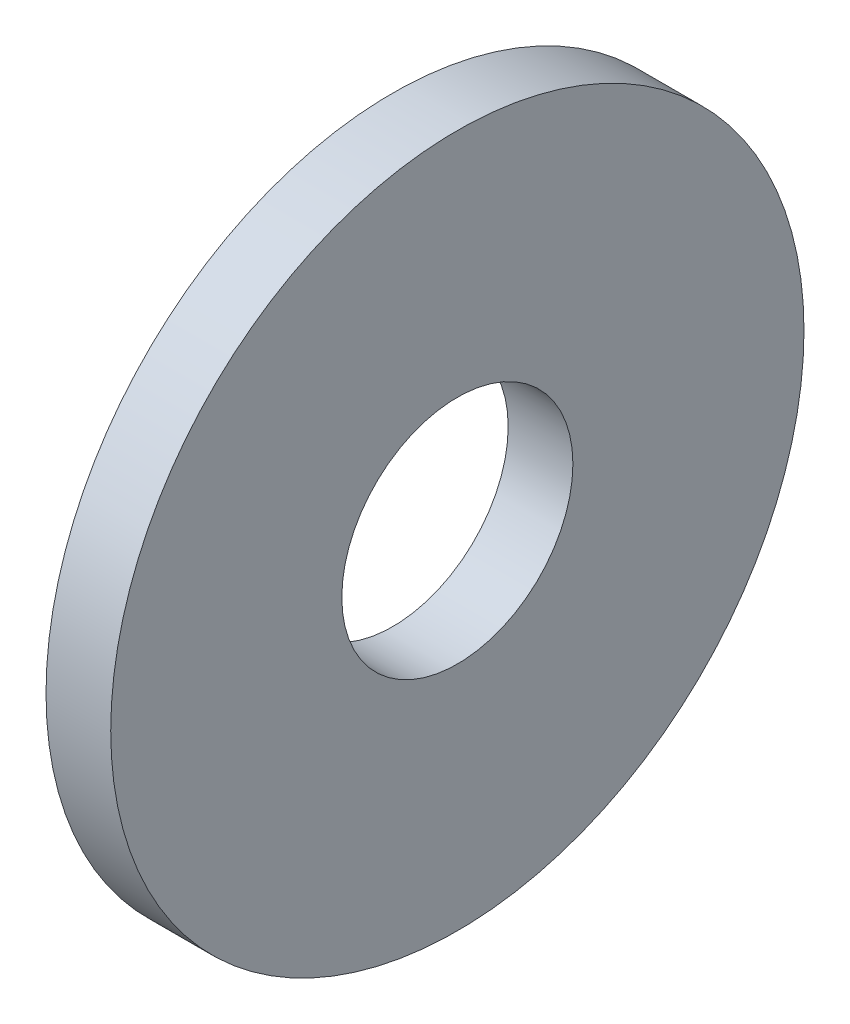
ISO-10303-21;
HEADER;
FILE_DESCRIPTION(('STEP AP214'),'2;1');
FILE_NAME('part.step','',(''),(''),'','','');
FILE_SCHEMA(('AUTOMOTIVE_DESIGN { 1 0 10303 214 1 1 1 1 }'));
ENDSEC;
DATA;
#1=APPLICATION_CONTEXT('core data for automotive mechanical design processes');
#2=APPLICATION_PROTOCOL_DEFINITION('international standard','automotive_design',2000,#1);
#3=PRODUCT_CONTEXT('',#1,'mechanical');
#4=PRODUCT('Part','Part','',(#3));
#5=PRODUCT_RELATED_PRODUCT_CATEGORY('part','',(#4));
#6=PRODUCT_DEFINITION_FORMATION('','',#4);
#7=PRODUCT_DEFINITION_CONTEXT('part definition',#1,'design');
#8=PRODUCT_DEFINITION('design','',#6,#7);
#9=PRODUCT_DEFINITION_SHAPE('','',#8);
#10=(LENGTH_UNIT() NAMED_UNIT(*) SI_UNIT(.MILLI.,.METRE.));
#11=(NAMED_UNIT(*) PLANE_ANGLE_UNIT() SI_UNIT($,.RADIAN.));
#12=(NAMED_UNIT(*) SI_UNIT($,.STERADIAN.) SOLID_ANGLE_UNIT());
#13=UNCERTAINTY_MEASURE_WITH_UNIT(LENGTH_MEASURE(1.E-05),#10,'distance_accuracy_value','');
#14=(GEOMETRIC_REPRESENTATION_CONTEXT(3) GLOBAL_UNCERTAINTY_ASSIGNED_CONTEXT((#13)) GLOBAL_UNIT_ASSIGNED_CONTEXT((#10,
#11,#12)) REPRESENTATION_CONTEXT('',''));
#15=CARTESIAN_POINT('',(0.,0.,0.));
#16=DIRECTION('',(0.,0.,1.));
#17=DIRECTION('',(1.,0.,0.));
#18=AXIS2_PLACEMENT_3D('',#15,#16,#17);
#19=CARTESIAN_POINT('',(3.556,0.,0.));
#20=DIRECTION('',(1.,0.,0.));
#21=DIRECTION('',(0.,0.,-1.));
#22=AXIS2_PLACEMENT_3D('',#19,#20,#21);
#23=PLANE('',#22);
#24=CARTESIAN_POINT('',(3.556,0.,0.));
#25=DIRECTION('',(1.,0.,0.));
#26=DIRECTION('',(0.,0.,-1.));
#27=AXIS2_PLACEMENT_3D('',#24,#25,#26);
#28=CIRCLE('',#27,19.05);
#29=CARTESIAN_POINT('',(3.556,0.,-19.05));
#30=VERTEX_POINT('',#29);
#31=EDGE_CURVE('E10',#30,#30,#28,.T.);
#32=ORIENTED_EDGE('',*,*,#31,.T.);
#33=EDGE_LOOP('',(#32));
#34=FACE_BOUND('',#33,.T.);
#35=CARTESIAN_POINT('',(3.556,0.,0.));
#36=DIRECTION('',(1.,0.,0.));
#37=DIRECTION('',(0.,0.,-1.));
#38=AXIS2_PLACEMENT_3D('',#35,#36,#37);
#39=CIRCLE('',#38,6.35);
#40=CARTESIAN_POINT('',(3.556,0.,-6.35));
#41=VERTEX_POINT('',#40);
#42=EDGE_CURVE('E41',#41,#41,#39,.T.);
#43=ORIENTED_EDGE('',*,*,#42,.F.);
#44=EDGE_LOOP('',(#43));
#45=FACE_BOUND('',#44,.T.);
#46=ADVANCED_FACE('F30',(#34,#45),#23,.T.);
#47=CARTESIAN_POINT('',(0.,0.,0.));
#48=DIRECTION('',(1.,0.,0.));
#49=DIRECTION('',(0.,0.,-1.));
#50=AXIS2_PLACEMENT_3D('',#47,#48,#49);
#51=PLANE('',#50);
#52=CARTESIAN_POINT('',(0.,0.,0.));
#53=DIRECTION('',(1.,0.,0.));
#54=DIRECTION('',(0.,0.,-1.));
#55=AXIS2_PLACEMENT_3D('',#52,#53,#54);
#56=CIRCLE('',#55,19.05);
#57=CARTESIAN_POINT('',(0.,0.,-19.05));
#58=VERTEX_POINT('',#57);
#59=EDGE_CURVE('E34',#58,#58,#56,.T.);
#60=ORIENTED_EDGE('',*,*,#59,.F.);
#61=EDGE_LOOP('',(#60));
#62=FACE_BOUND('',#61,.T.);
#63=CARTESIAN_POINT('',(0.,0.,0.));
#64=DIRECTION('',(1.,0.,0.));
#65=DIRECTION('',(0.,0.,-1.));
#66=AXIS2_PLACEMENT_3D('',#63,#64,#65);
#67=CIRCLE('',#66,6.35);
#68=CARTESIAN_POINT('',(0.,0.,-6.35));
#69=VERTEX_POINT('',#68);
#70=EDGE_CURVE('E43',#69,#69,#67,.T.);
#71=ORIENTED_EDGE('',*,*,#70,.T.);
#72=EDGE_LOOP('',(#71));
#73=FACE_BOUND('',#72,.T.);
#74=ADVANCED_FACE('F53',(#62,#73),#51,.F.);
#75=CARTESIAN_POINT('',(3.556,0.,0.));
#76=DIRECTION('',(-1.,0.,0.));
#77=DIRECTION('',(0.,0.,1.));
#78=AXIS2_PLACEMENT_3D('',#75,#76,#77);
#79=CYLINDRICAL_SURFACE('',#78,19.05);
#80=ORIENTED_EDGE('',*,*,#31,.F.);
#81=EDGE_LOOP('',(#80));
#82=FACE_BOUND('',#81,.T.);
#83=ORIENTED_EDGE('',*,*,#59,.T.);
#84=EDGE_LOOP('',(#83));
#85=FACE_BOUND('',#84,.T.);
#86=ADVANCED_FACE('F32',(#82,#85),#79,.T.);
#87=CARTESIAN_POINT('',(3.556,0.,0.));
#88=DIRECTION('',(-1.,0.,0.));
#89=DIRECTION('',(0.,0.,1.));
#90=AXIS2_PLACEMENT_3D('',#87,#88,#89);
#91=CYLINDRICAL_SURFACE('',#90,6.35);
#92=ORIENTED_EDGE('',*,*,#42,.T.);
#93=EDGE_LOOP('',(#92));
#94=FACE_BOUND('',#93,.T.);
#95=ORIENTED_EDGE('',*,*,#70,.F.);
#96=EDGE_LOOP('',(#95));
#97=FACE_BOUND('',#96,.T.);
#98=ADVANCED_FACE('F49',(#94,#97),#91,.F.);
#99=CLOSED_SHELL('',(#46,#74,#86,#98));
#100=MANIFOLD_SOLID_BREP('B2',#99);
#101=ADVANCED_BREP_SHAPE_REPRESENTATION('',(#18,#100),#14);
#102=SHAPE_DEFINITION_REPRESENTATION(#9,#101);
ENDSEC;
END-ISO-10303-21;
